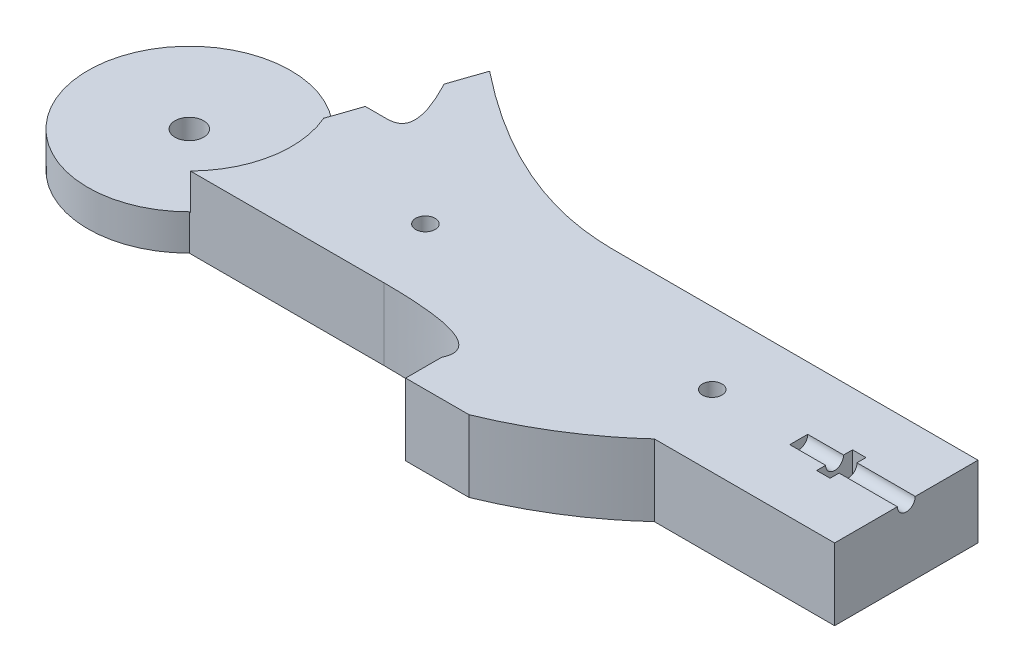
ISO-10303-21;
HEADER;
FILE_DESCRIPTION(('STEP AP214'),'2;1');
FILE_NAME('part.step','',(''),(''),'','','');
FILE_SCHEMA(('AUTOMOTIVE_DESIGN { 1 0 10303 214 1 1 1 1 }'));
ENDSEC;
DATA;
#1=APPLICATION_CONTEXT('core data for automotive mechanical design processes');
#2=APPLICATION_PROTOCOL_DEFINITION('international standard','automotive_design',2000,#1);
#3=PRODUCT_CONTEXT('',#1,'mechanical');
#4=PRODUCT('Part','Part','',(#3));
#5=PRODUCT_RELATED_PRODUCT_CATEGORY('part','',(#4));
#6=PRODUCT_DEFINITION_FORMATION('','',#4);
#7=PRODUCT_DEFINITION_CONTEXT('part definition',#1,'design');
#8=PRODUCT_DEFINITION('design','',#6,#7);
#9=PRODUCT_DEFINITION_SHAPE('','',#8);
#10=(LENGTH_UNIT() NAMED_UNIT(*) SI_UNIT(.MILLI.,.METRE.));
#11=(NAMED_UNIT(*) PLANE_ANGLE_UNIT() SI_UNIT($,.RADIAN.));
#12=(NAMED_UNIT(*) SI_UNIT($,.STERADIAN.) SOLID_ANGLE_UNIT());
#13=UNCERTAINTY_MEASURE_WITH_UNIT(LENGTH_MEASURE(1.E-05),#10,'distance_accuracy_value','');
#14=(GEOMETRIC_REPRESENTATION_CONTEXT(3) GLOBAL_UNCERTAINTY_ASSIGNED_CONTEXT((#13)) GLOBAL_UNIT_ASSIGNED_CONTEXT((#10,
#11,#12)) REPRESENTATION_CONTEXT('',''));
#15=CARTESIAN_POINT('',(0.,0.,0.));
#16=DIRECTION('',(0.,0.,1.));
#17=DIRECTION('',(1.,0.,0.));
#18=AXIS2_PLACEMENT_3D('',#15,#16,#17);
#19=CARTESIAN_POINT('',(-56.5620370370371,12.7,6.10151852993586));
#20=DIRECTION('',(0.,0.,-1.));
#21=DIRECTION('',(1.,0.,0.));
#22=AXIS2_PLACEMENT_3D('',#19,#20,#21);
#23=PLANE('',#22);
#24=DIRECTION('',(0.,1.,0.));
#25=VECTOR('',#24,1.);
#26=CARTESIAN_POINT('',(-22.0521428441884,-49.5130237421217,6.10151852993586));
#27=LINE('',#26,#25);
#28=CARTESIAN_POINT('',(-22.0521428441884,0.,6.10151852993586));
#29=VERTEX_POINT('',#28);
#30=CARTESIAN_POINT('',(-22.0521428441884,12.7,6.10151852993586));
#31=VERTEX_POINT('',#30);
#32=EDGE_CURVE('E221',#29,#31,#27,.T.);
#33=ORIENTED_EDGE('',*,*,#32,.T.);
#34=DIRECTION('',(-1.,0.,0.));
#35=VECTOR('',#34,1.);
#36=CARTESIAN_POINT('',(-56.5620370370371,12.7,6.10151852993586));
#37=LINE('',#36,#35);
#38=CARTESIAN_POINT('',(-56.3690348168402,12.7,6.10151852993586));
#39=VERTEX_POINT('',#38);
#40=EDGE_CURVE('E217',#31,#39,#37,.T.);
#41=ORIENTED_EDGE('',*,*,#40,.T.);
#42=DIRECTION('',(0.,1.,0.));
#43=VECTOR('',#42,1.);
#44=CARTESIAN_POINT('',(-56.3690348168402,6.35,6.10151852993586));
#45=LINE('',#44,#43);
#46=CARTESIAN_POINT('',(-56.3690348168402,6.35,6.10151852993586));
#47=VERTEX_POINT('',#46);
#48=EDGE_CURVE('E399',#47,#39,#45,.T.);
#49=ORIENTED_EDGE('',*,*,#48,.F.);
#50=DIRECTION('',(-1.,0.,0.));
#51=VECTOR('',#50,1.);
#52=CARTESIAN_POINT('',(-56.5620370370371,6.35,6.10151852993586));
#53=LINE('',#52,#51);
#54=CARTESIAN_POINT('',(-56.5620370370371,6.35,6.10151852993585));
#55=VERTEX_POINT('',#54);
#56=EDGE_CURVE('E396',#47,#55,#53,.T.);
#57=ORIENTED_EDGE('',*,*,#56,.T.);
#58=DIRECTION('',(0.,-1.,0.));
#59=VECTOR('',#58,1.);
#60=CARTESIAN_POINT('',(-56.5620370370371,12.7,6.10151852993586));
#61=LINE('',#60,#59);
#62=CARTESIAN_POINT('',(-56.5620370370371,0.,6.10151852993586));
#63=VERTEX_POINT('',#62);
#64=EDGE_CURVE('E435',#55,#63,#61,.T.);
#65=ORIENTED_EDGE('',*,*,#64,.T.);
#66=DIRECTION('',(-1.,0.,0.));
#67=VECTOR('',#66,1.);
#68=CARTESIAN_POINT('',(-56.5620370370371,0.,6.10151852993586));
#69=LINE('',#68,#67);
#70=EDGE_CURVE('E419',#29,#63,#69,.T.);
#71=ORIENTED_EDGE('',*,*,#70,.F.);
#72=EDGE_LOOP('',(#33,#41,#49,#57,#65,#71));
#73=FACE_BOUND('',#72,.T.);
#74=ADVANCED_FACE('F37',(#73),#23,.F.);
#75=DIRECTION('',(0.,1.,0.));
#76=VECTOR('',#75,1.);
#77=CARTESIAN_POINT('',(25.8044086413491,-49.5130237421217,6.10151852993586));
#78=LINE('',#77,#76);
#79=CARTESIAN_POINT('',(25.8044086413491,0.,6.10151852993586));
#80=VERTEX_POINT('',#79);
#81=CARTESIAN_POINT('',(25.8044086413491,12.7,6.10151852993586));
#82=VERTEX_POINT('',#81);
#83=EDGE_CURVE('E256',#80,#82,#78,.T.);
#84=ORIENTED_EDGE('',*,*,#83,.F.);
#85=CARTESIAN_POINT('',(57.7379629629629,0.,6.10151852993586));
#86=VERTEX_POINT('',#85);
#87=EDGE_CURVE('E420',#86,#80,#69,.T.);
#88=ORIENTED_EDGE('',*,*,#87,.F.);
#89=DIRECTION('',(0.,-1.,0.));
#90=VECTOR('',#89,1.);
#91=CARTESIAN_POINT('',(57.7379629629629,12.7,6.10151852993586));
#92=LINE('',#91,#90);
#93=CARTESIAN_POINT('',(57.7379629629629,12.7,6.10151852993586));
#94=VERTEX_POINT('',#93);
#95=EDGE_CURVE('E438',#94,#86,#92,.T.);
#96=ORIENTED_EDGE('',*,*,#95,.F.);
#97=EDGE_CURVE('E410',#94,#82,#37,.T.);
#98=ORIENTED_EDGE('',*,*,#97,.T.);
#99=EDGE_LOOP('',(#84,#88,#96,#98));
#100=FACE_BOUND('',#99,.T.);
#101=ADVANCED_FACE('F575',(#100),#23,.F.);
#102=CARTESIAN_POINT('',(-56.5620370370371,12.7,-19.2984814700641));
#103=DIRECTION('',(0.,0.,1.));
#104=DIRECTION('',(-1.,0.,0.));
#105=AXIS2_PLACEMENT_3D('',#102,#103,#104);
#106=PLANE('',#105);
#107=DIRECTION('',(0.,1.,0.));
#108=VECTOR('',#107,1.);
#109=CARTESIAN_POINT('',(-5.57588640904783,-44.9106074814327,-19.2984814700641));
#110=LINE('',#109,#108);
#111=CARTESIAN_POINT('',(-5.57588640904783,0.,-19.2984814700641));
#112=VERTEX_POINT('',#111);
#113=CARTESIAN_POINT('',(-5.57588640904783,12.7,-19.2984814700641));
#114=VERTEX_POINT('',#113);
#115=EDGE_CURVE('E488',#112,#114,#110,.T.);
#116=ORIENTED_EDGE('',*,*,#115,.T.);
#117=DIRECTION('',(1.,0.,0.));
#118=VECTOR('',#117,1.);
#119=CARTESIAN_POINT('',(-56.5620370370371,12.7,-19.2984814700641));
#120=LINE('',#119,#118);
#121=CARTESIAN_POINT('',(57.7379629629629,12.7,-19.2984814700641));
#122=VERTEX_POINT('',#121);
#123=EDGE_CURVE('E413',#114,#122,#120,.T.);
#124=ORIENTED_EDGE('',*,*,#123,.T.);
#125=DIRECTION('',(0.,-1.,0.));
#126=VECTOR('',#125,1.);
#127=CARTESIAN_POINT('',(57.7379629629629,12.7,-19.2984814700641));
#128=LINE('',#127,#126);
#129=CARTESIAN_POINT('',(57.7379629629629,0.,-19.2984814700641));
#130=VERTEX_POINT('',#129);
#131=EDGE_CURVE('E417',#122,#130,#128,.T.);
#132=ORIENTED_EDGE('',*,*,#131,.T.);
#133=DIRECTION('',(1.,0.,0.));
#134=VECTOR('',#133,1.);
#135=CARTESIAN_POINT('',(-56.5620370370371,0.,-19.2984814700641));
#136=LINE('',#135,#134);
#137=EDGE_CURVE('E426',#112,#130,#136,.T.);
#138=ORIENTED_EDGE('',*,*,#137,.F.);
#139=EDGE_LOOP('',(#116,#124,#132,#138));
#140=FACE_BOUND('',#139,.T.);
#141=ADVANCED_FACE('F489',(#140),#106,.F.);
#142=CARTESIAN_POINT('',(38.6879629629629,12.7,-6.59848147006414));
#143=DIRECTION('',(1.,0.,0.));
#144=DIRECTION('',(0.,0.,1.));
#145=AXIS2_PLACEMENT_3D('',#142,#143,#144);
#146=CYLINDRICAL_SURFACE('',#145,1.5875);
#147=DIRECTION('',(1.,0.,0.));
#148=VECTOR('',#147,1.);
#149=CARTESIAN_POINT('',(38.6879629629629,12.7,-8.18598147006414));
#150=LINE('',#149,#148);
#151=CARTESIAN_POINT('',(45.0379629629629,12.7,-8.18598147006414));
#152=VERTEX_POINT('',#151);
#153=CARTESIAN_POINT('',(38.6879629629629,12.7,-8.18598147006414));
#154=VERTEX_POINT('',#153);
#155=EDGE_CURVE('E353',#152,#154,#150,.F.);
#156=ORIENTED_EDGE('',*,*,#155,.T.);
#157=CARTESIAN_POINT('',(38.6879629629629,12.7,-6.59848147006414));
#158=DIRECTION('',(-1.,0.,0.));
#159=DIRECTION('',(0.,0.,1.));
#160=AXIS2_PLACEMENT_3D('',#157,#158,#159);
#161=CIRCLE('',#160,1.5875);
#162=CARTESIAN_POINT('',(38.6879629629629,12.7,-5.01098147006414));
#163=VERTEX_POINT('',#162);
#164=EDGE_CURVE('E350',#154,#163,#161,.T.);
#165=ORIENTED_EDGE('',*,*,#164,.T.);
#166=DIRECTION('',(1.,0.,0.));
#167=VECTOR('',#166,1.);
#168=CARTESIAN_POINT('',(38.6879629629629,12.7,-5.01098147006414));
#169=LINE('',#168,#167);
#170=CARTESIAN_POINT('',(45.0379629629629,12.7,-5.01098147006415));
#171=VERTEX_POINT('',#170);
#172=EDGE_CURVE('E358',#163,#171,#169,.T.);
#173=ORIENTED_EDGE('',*,*,#172,.T.);
#174=CARTESIAN_POINT('',(45.0379629629629,12.7,-6.59848147006414));
#175=DIRECTION('',(1.,0.,0.));
#176=DIRECTION('',(0.,0.,-1.));
#177=AXIS2_PLACEMENT_3D('',#174,#175,#176);
#178=CIRCLE('',#177,1.5875);
#179=EDGE_CURVE('E11',#152,#171,#178,.F.);
#180=ORIENTED_EDGE('',*,*,#179,.F.);
#181=EDGE_LOOP('',(#156,#165,#173,#180));
#182=FACE_BOUND('',#181,.T.);
#183=ADVANCED_FACE('F571',(#182),#146,.F.);
#184=CARTESIAN_POINT('',(-69.262037037037,12.7,-6.59848147006414));
#185=DIRECTION('',(0.,-1.,0.));
#186=DIRECTION('',(0.,0.,1.));
#187=AXIS2_PLACEMENT_3D('',#184,#185,#186);
#188=CYLINDRICAL_SURFACE('',#187,17.9605122421383);
#189=CARTESIAN_POINT('',(-69.262037037037,6.35,-6.59848147006414));
#190=DIRECTION('',(0.,-1.,0.));
#191=DIRECTION('',(0.,0.,-1.));
#192=AXIS2_PLACEMENT_3D('',#189,#190,#191);
#193=CIRCLE('',#192,17.9605122421383);
#194=CARTESIAN_POINT('',(-56.5620370370371,6.35,-19.2984814700641));
#195=VERTEX_POINT('',#194);
#196=EDGE_CURVE('E393',#55,#195,#193,.T.);
#197=ORIENTED_EDGE('',*,*,#196,.T.);
#198=DIRECTION('',(0.,-1.,0.));
#199=VECTOR('',#198,1.);
#200=CARTESIAN_POINT('',(-56.5620370370371,12.7,-19.2984814700641));
#201=LINE('',#200,#199);
#202=CARTESIAN_POINT('',(-56.5620370370371,0.,-19.2984814700641));
#203=VERTEX_POINT('',#202);
#204=EDGE_CURVE('E432',#195,#203,#201,.T.);
#205=ORIENTED_EDGE('',*,*,#204,.T.);
#206=CARTESIAN_POINT('',(-69.262037037037,0.,-6.59848147006414));
#207=DIRECTION('',(0.,-1.,0.));
#208=DIRECTION('',(0.,0.,1.));
#209=AXIS2_PLACEMENT_3D('',#206,#207,#208);
#210=CIRCLE('',#209,17.9605122421383);
#211=EDGE_CURVE('E423',#63,#203,#210,.T.);
#212=ORIENTED_EDGE('',*,*,#211,.F.);
#213=ORIENTED_EDGE('',*,*,#64,.F.);
#214=EDGE_LOOP('',(#197,#205,#212,#213));
#215=FACE_BOUND('',#214,.T.);
#216=ADVANCED_FACE('F552',(#215),#188,.T.);
#217=CARTESIAN_POINT('',(-69.262037037037,12.7,-6.59848147006414));
#218=DIRECTION('',(0.,-1.,0.));
#219=DIRECTION('',(0.,0.,1.));
#220=AXIS2_PLACEMENT_3D('',#217,#218,#219);
#221=CYLINDRICAL_SURFACE('',#220,2.54);
#222=CARTESIAN_POINT('',(-69.262037037037,0.,-6.59848147006414));
#223=DIRECTION('',(0.,-1.,0.));
#224=DIRECTION('',(0.,0.,-1.));
#225=AXIS2_PLACEMENT_3D('',#222,#223,#224);
#226=CIRCLE('',#225,2.54);
#227=CARTESIAN_POINT('',(-69.262037037037,0.,-9.13848147006414));
#228=VERTEX_POINT('',#227);
#229=EDGE_CURVE('E402',#228,#228,#226,.T.);
#230=ORIENTED_EDGE('',*,*,#229,.T.);
#231=EDGE_LOOP('',(#230));
#232=FACE_BOUND('',#231,.T.);
#233=CARTESIAN_POINT('',(-69.262037037037,6.35,-6.59848147006414));
#234=DIRECTION('',(0.,-1.,0.));
#235=DIRECTION('',(0.,0.,-1.));
#236=AXIS2_PLACEMENT_3D('',#233,#234,#235);
#237=CIRCLE('',#236,2.54);
#238=CARTESIAN_POINT('',(-69.262037037037,6.35,-9.13848147006414));
#239=VERTEX_POINT('',#238);
#240=EDGE_CURVE('E388',#239,#239,#237,.T.);
#241=ORIENTED_EDGE('',*,*,#240,.F.);
#242=EDGE_LOOP('',(#241));
#243=FACE_BOUND('',#242,.T.);
#244=ADVANCED_FACE('F561',(#232,#243),#221,.F.);
#245=CARTESIAN_POINT('',(-69.262037037037,12.7,-6.59848147006414));
#246=DIRECTION('',(0.,-1.,0.));
#247=DIRECTION('',(0.,0.,1.));
#248=AXIS2_PLACEMENT_3D('',#245,#246,#247);
#249=PLANE('',#248);
#250=CARTESIAN_POINT('',(-27.4422931581062,12.7,-6.59848147006414));
#251=DIRECTION('',(0.,1.,0.));
#252=DIRECTION('',(0.,0.,1.));
#253=AXIS2_PLACEMENT_3D('',#250,#251,#252);
#254=CIRCLE('',#253,1.72720000000001);
#255=CARTESIAN_POINT('',(-27.4422931581062,12.7,-4.87128147006413));
#256=VERTEX_POINT('',#255);
#257=EDGE_CURVE('E370',#256,#256,#254,.T.);
#258=ORIENTED_EDGE('',*,*,#257,.F.);
#259=EDGE_LOOP('',(#258));
#260=FACE_BOUND('',#259,.T.);
#261=CARTESIAN_POINT('',(23.3577068418938,12.7,-6.59848147006414));
#262=DIRECTION('',(0.,1.,0.));
#263=DIRECTION('',(0.,0.,1.));
#264=AXIS2_PLACEMENT_3D('',#261,#262,#263);
#265=CIRCLE('',#264,1.72720000000001);
#266=CARTESIAN_POINT('',(23.3577068418938,12.7,-4.87128147006413));
#267=VERTEX_POINT('',#266);
#268=EDGE_CURVE('E382',#267,#267,#265,.T.);
#269=ORIENTED_EDGE('',*,*,#268,.F.);
#270=EDGE_LOOP('',(#269));
#271=FACE_BOUND('',#270,.T.);
#272=ORIENTED_EDGE('',*,*,#172,.F.);
#273=DIRECTION('',(0.,0.,-1.));
#274=VECTOR('',#273,1.);
#275=CARTESIAN_POINT('',(38.6879629629629,12.7,-6.59848147006414));
#276=LINE('',#275,#274);
#277=EDGE_CURVE('E445',#163,#154,#276,.T.);
#278=ORIENTED_EDGE('',*,*,#277,.T.);
#279=ORIENTED_EDGE('',*,*,#155,.F.);
#280=DIRECTION('',(0.,0.,-1.));
#281=VECTOR('',#280,1.);
#282=CARTESIAN_POINT('',(45.0379629629629,12.7,-9.77348147006416));
#283=LINE('',#282,#281);
#284=CARTESIAN_POINT('',(45.0379629629629,12.7,-9.77348147006416));
#285=VERTEX_POINT('',#284);
#286=EDGE_CURVE('E329',#152,#285,#283,.T.);
#287=ORIENTED_EDGE('',*,*,#286,.T.);
#288=DIRECTION('',(1.,0.,0.));
#289=VECTOR('',#288,1.);
#290=CARTESIAN_POINT('',(45.0379629629629,12.7,-9.77348147006416));
#291=LINE('',#290,#289);
#292=CARTESIAN_POINT('',(47.4192129629629,12.7,-9.77348147006416));
#293=VERTEX_POINT('',#292);
#294=EDGE_CURVE('E318',#285,#293,#291,.T.);
#295=ORIENTED_EDGE('',*,*,#294,.T.);
#296=DIRECTION('',(0.,0.,1.));
#297=VECTOR('',#296,1.);
#298=CARTESIAN_POINT('',(47.4192129629629,12.7,-3.42348147006413));
#299=LINE('',#298,#297);
#300=CARTESIAN_POINT('',(47.4192129629629,12.7,-8.18598147006414));
#301=VERTEX_POINT('',#300);
#302=EDGE_CURVE('E323',#293,#301,#299,.T.);
#303=ORIENTED_EDGE('',*,*,#302,.T.);
#304=CARTESIAN_POINT('',(57.7379629629629,12.7,-8.18598147006414));
#305=VERTEX_POINT('',#304);
#306=EDGE_CURVE('E354',#305,#301,#150,.F.);
#307=ORIENTED_EDGE('',*,*,#306,.F.);
#308=DIRECTION('',(0.,0.,1.));
#309=VECTOR('',#308,1.);
#310=CARTESIAN_POINT('',(57.7379629629629,12.7,6.10151852993586));
#311=LINE('',#310,#309);
#312=EDGE_CURVE('E406',#122,#305,#311,.T.);
#313=ORIENTED_EDGE('',*,*,#312,.F.);
#314=ORIENTED_EDGE('',*,*,#123,.F.);
#315=CARTESIAN_POINT('',(-45.1817352564269,12.7,-35.7159023104307));
#316=CARTESIAN_POINT('',(-24.6245664486509,12.7,-19.2984814700641));
#317=CARTESIAN_POINT('',(-11.56568916727,12.7,-19.2984814700641));
#318=CARTESIAN_POINT('',(-5.57588640904783,12.7,-19.2984814700641));
#319=B_SPLINE_CURVE_WITH_KNOTS('',3,(#315,#316,#317,#318),.UNSPECIFIED.,.F.,.F.,(4,4),(0.,1.),.UNSPECIFIED.);
#320=CARTESIAN_POINT('',(-45.1817352564269,12.7,-35.7159023104307));
#321=VERTEX_POINT('',#320);
#322=EDGE_CURVE('E484',#321,#114,#319,.T.);
#323=ORIENTED_EDGE('',*,*,#322,.F.);
#324=DIRECTION('',(-0.322805874294675,0.,0.946465196148728));
#325=VECTOR('',#324,1.);
#326=CARTESIAN_POINT('',(-45.1817352564269,12.7,-35.7159023104307));
#327=LINE('',#326,#325);
#328=CARTESIAN_POINT('',(-47.2315525581981,12.7,-29.7058483148863));
#329=VERTEX_POINT('',#328);
#330=EDGE_CURVE('E322',#321,#329,#327,.T.);
#331=ORIENTED_EDGE('',*,*,#330,.T.);
#332=CARTESIAN_POINT('',(-47.2315525581981,12.7,-29.7058483148863));
#333=CARTESIAN_POINT('',(-41.7251153372007,12.7,-19.2984814700641));
#334=CARTESIAN_POINT('',(-45.408751787825,12.7,-19.2984814700641));
#335=CARTESIAN_POINT('',(-47.3781705248904,12.7,-19.2984814700641));
#336=B_SPLINE_CURVE_WITH_KNOTS('',3,(#332,#333,#334,#335),.UNSPECIFIED.,.F.,.F.,(4,4),(0.,1.),.UNSPECIFIED.);
#337=CARTESIAN_POINT('',(-47.3781705248904,12.7,-19.2984814700641));
#338=VERTEX_POINT('',#337);
#339=EDGE_CURVE('E500',#329,#338,#336,.T.);
#340=ORIENTED_EDGE('',*,*,#339,.T.);
#341=CARTESIAN_POINT('',(-50.7811380761005,12.7,-19.2984814700641));
#342=VERTEX_POINT('',#341);
#343=EDGE_CURVE('E414',#342,#338,#120,.T.);
#344=ORIENTED_EDGE('',*,*,#343,.F.);
#345=DIRECTION('',(-0.322805874294675,0.,0.946465196148728));
#346=VECTOR('',#345,1.);
#347=CARTESIAN_POINT('',(-50.7811380761005,12.7,-19.2984814700641));
#348=LINE('',#347,#346);
#349=CARTESIAN_POINT('',(-52.6576296854306,12.7,-13.796617531012));
#350=VERTEX_POINT('',#349);
#351=EDGE_CURVE('E341',#342,#350,#348,.T.);
#352=ORIENTED_EDGE('',*,*,#351,.T.);
#353=CARTESIAN_POINT('',(-69.262037037037,12.7,-6.59848147006414));
#354=DIRECTION('',(0.,-1.,0.));
#355=DIRECTION('',(0.,0.,-1.));
#356=AXIS2_PLACEMENT_3D('',#353,#354,#355);
#357=CIRCLE('',#356,18.0975);
#358=EDGE_CURVE('E385',#350,#39,#357,.T.);
#359=ORIENTED_EDGE('',*,*,#358,.T.);
#360=ORIENTED_EDGE('',*,*,#40,.F.);
#361=CARTESIAN_POINT('',(-5.54086763995443,12.7,12.4515185299359));
#362=CARTESIAN_POINT('',(-2.45676013605589,12.7,6.10151852993586));
#363=CARTESIAN_POINT('',(-22.0521428441884,12.7,6.10151852993586));
#364=B_SPLINE_CURVE_WITH_KNOTS('',2,(#361,#362,#363),.UNSPECIFIED.,.F.,.F.,(3,3),(0.,1.),.UNSPECIFIED.);
#365=CARTESIAN_POINT('',(-5.54086763995443,12.7,12.4515185299359));
#366=VERTEX_POINT('',#365);
#367=EDGE_CURVE('E60',#366,#31,#364,.T.);
#368=ORIENTED_EDGE('',*,*,#367,.F.);
#369=DIRECTION('',(0.,0.,1.));
#370=VECTOR('',#369,1.);
#371=CARTESIAN_POINT('',(-5.54086763995443,12.7,12.4515185299359));
#372=LINE('',#371,#370);
#373=CARTESIAN_POINT('',(-5.54086763995443,12.7,18.8015185299359));
#374=VERTEX_POINT('',#373);
#375=EDGE_CURVE('E203',#366,#374,#372,.T.);
#376=ORIENTED_EDGE('',*,*,#375,.T.);
#377=DIRECTION('',(1.,0.,0.));
#378=VECTOR('',#377,1.);
#379=CARTESIAN_POINT('',(-5.54086763995443,12.7,18.8015185299359));
#380=LINE('',#379,#378);
#381=CARTESIAN_POINT('',(5.68711721311388,12.7,18.8015185299359));
#382=VERTEX_POINT('',#381);
#383=EDGE_CURVE('E204',#374,#382,#380,.T.);
#384=ORIENTED_EDGE('',*,*,#383,.T.);
#385=CARTESIAN_POINT('',(5.68711721311388,12.7,18.8015185299359));
#386=CARTESIAN_POINT('',(17.0941996057411,12.7,14.1176448631186));
#387=CARTESIAN_POINT('',(25.8044086413491,12.7,6.10151852993586));
#388=B_SPLINE_CURVE_WITH_KNOTS('',2,(#385,#386,#387),.UNSPECIFIED.,.F.,.F.,(3,3),(0.,
0.7699329234087),.UNSPECIFIED.);
#389=EDGE_CURVE('E228',#382,#82,#388,.T.);
#390=ORIENTED_EDGE('',*,*,#389,.T.);
#391=ORIENTED_EDGE('',*,*,#97,.F.);
#392=CARTESIAN_POINT('',(57.7379629629629,12.7,-5.01098147006414));
#393=VERTEX_POINT('',#392);
#394=EDGE_CURVE('E409',#393,#94,#311,.T.);
#395=ORIENTED_EDGE('',*,*,#394,.F.);
#396=CARTESIAN_POINT('',(47.4192129629629,12.7,-5.01098147006414));
#397=VERTEX_POINT('',#396);
#398=EDGE_CURVE('E357',#397,#393,#169,.T.);
#399=ORIENTED_EDGE('',*,*,#398,.F.);
#400=CARTESIAN_POINT('',(47.4192129629629,12.7,-3.42348147006413));
#401=VERTEX_POINT('',#400);
#402=EDGE_CURVE('E321',#397,#401,#299,.T.);
#403=ORIENTED_EDGE('',*,*,#402,.T.);
#404=DIRECTION('',(-1.,0.,0.));
#405=VECTOR('',#404,1.);
#406=CARTESIAN_POINT('',(45.0379629629629,12.7,-3.42348147006413));
#407=LINE('',#406,#405);
#408=CARTESIAN_POINT('',(45.0379629629629,12.7,-3.42348147006413));
#409=VERTEX_POINT('',#408);
#410=EDGE_CURVE('E326',#401,#409,#407,.T.);
#411=ORIENTED_EDGE('',*,*,#410,.T.);
#412=EDGE_CURVE('E330',#409,#171,#283,.T.);
#413=ORIENTED_EDGE('',*,*,#412,.T.);
#414=EDGE_LOOP('',(#272,#278,#279,#287,#295,#303,#307,#313,#314,#323,#331,#340,#344,#352,#359,
#360,#368,#376,#384,#390,#391,#395,#399,#403,#411,#413));
#415=FACE_BOUND('',#414,.T.);
#416=ADVANCED_FACE('F215',(#260,#271,#415),#249,.F.);
#417=CARTESIAN_POINT('',(-69.262037037037,0.,-6.59848147006414));
#418=DIRECTION('',(0.,-1.,0.));
#419=DIRECTION('',(0.,0.,1.));
#420=AXIS2_PLACEMENT_3D('',#417,#418,#419);
#421=PLANE('',#420);
#422=CARTESIAN_POINT('',(-27.4422931581062,0.,-6.59848147006414));
#423=DIRECTION('',(0.,1.,0.));
#424=DIRECTION('',(0.,0.,1.));
#425=AXIS2_PLACEMENT_3D('',#422,#423,#424);
#426=CIRCLE('',#425,3.77062999999999);
#427=CARTESIAN_POINT('',(-27.4422931581062,0.,-2.82785147006415));
#428=VERTEX_POINT('',#427);
#429=EDGE_CURVE('E361',#428,#428,#426,.T.);
#430=ORIENTED_EDGE('',*,*,#429,.T.);
#431=EDGE_LOOP('',(#430));
#432=FACE_BOUND('',#431,.T.);
#433=CARTESIAN_POINT('',(23.3577068418938,0.,-6.59848147006414));
#434=DIRECTION('',(0.,1.,0.));
#435=DIRECTION('',(0.,0.,1.));
#436=AXIS2_PLACEMENT_3D('',#433,#434,#435);
#437=CIRCLE('',#436,3.77062999999999);
#438=CARTESIAN_POINT('',(23.3577068418938,0.,-2.82785147006415));
#439=VERTEX_POINT('',#438);
#440=EDGE_CURVE('E373',#439,#439,#437,.T.);
#441=ORIENTED_EDGE('',*,*,#440,.T.);
#442=EDGE_LOOP('',(#441));
#443=FACE_BOUND('',#442,.T.);
#444=DIRECTION('',(0.,0.,1.));
#445=VECTOR('',#444,1.);
#446=CARTESIAN_POINT('',(57.7379629629629,0.,6.10151852993586));
#447=LINE('',#446,#445);
#448=EDGE_CURVE('E405',#130,#86,#447,.T.);
#449=ORIENTED_EDGE('',*,*,#448,.T.);
#450=ORIENTED_EDGE('',*,*,#87,.T.);
#451=CARTESIAN_POINT('',(5.68711721311388,0.,18.8015185299359));
#452=CARTESIAN_POINT('',(17.0941996057411,0.,14.1176448631186));
#453=CARTESIAN_POINT('',(25.8044086413491,0.,6.10151852993586));
#454=B_SPLINE_CURVE_WITH_KNOTS('',2,(#451,#452,#453),.UNSPECIFIED.,.F.,.F.,(3,3),(0.,
0.7699329234087),.UNSPECIFIED.);
#455=CARTESIAN_POINT('',(5.68711721311388,0.,18.8015185299359));
#456=VERTEX_POINT('',#455);
#457=EDGE_CURVE('E219',#456,#80,#454,.T.);
#458=ORIENTED_EDGE('',*,*,#457,.F.);
#459=DIRECTION('',(1.,0.,0.));
#460=VECTOR('',#459,1.);
#461=CARTESIAN_POINT('',(-5.54086763995443,0.,18.8015185299359));
#462=LINE('',#461,#460);
#463=CARTESIAN_POINT('',(-5.54086763995443,0.,18.8015185299359));
#464=VERTEX_POINT('',#463);
#465=EDGE_CURVE('E223',#464,#456,#462,.T.);
#466=ORIENTED_EDGE('',*,*,#465,.F.);
#467=DIRECTION('',(0.,0.,1.));
#468=VECTOR('',#467,1.);
#469=CARTESIAN_POINT('',(-5.54086763995443,0.,12.4515185299359));
#470=LINE('',#469,#468);
#471=CARTESIAN_POINT('',(-5.54086763995443,0.,12.4515185299359));
#472=VERTEX_POINT('',#471);
#473=EDGE_CURVE('E242',#472,#464,#470,.T.);
#474=ORIENTED_EDGE('',*,*,#473,.F.);
#475=CARTESIAN_POINT('',(-5.54086763995443,0.,12.4515185299359));
#476=CARTESIAN_POINT('',(-2.45676013605589,0.,6.10151852993586));
#477=CARTESIAN_POINT('',(-22.0521428441884,0.,6.10151852993586));
#478=B_SPLINE_CURVE_WITH_KNOTS('',2,(#475,#476,#477),.UNSPECIFIED.,.F.,.F.,(3,3),(0.,1.),.UNSPECIFIED.);
#479=EDGE_CURVE('E52',#472,#29,#478,.T.);
#480=ORIENTED_EDGE('',*,*,#479,.T.);
#481=ORIENTED_EDGE('',*,*,#70,.T.);
#482=ORIENTED_EDGE('',*,*,#211,.T.);
#483=CARTESIAN_POINT('',(-47.3781705248904,0.,-19.2984814700641));
#484=VERTEX_POINT('',#483);
#485=EDGE_CURVE('E427',#203,#484,#136,.T.);
#486=ORIENTED_EDGE('',*,*,#485,.T.);
#487=CARTESIAN_POINT('',(-47.2315525581981,0.,-29.7058483148863));
#488=CARTESIAN_POINT('',(-41.7251153372007,0.,-19.2984814700641));
#489=CARTESIAN_POINT('',(-45.408751787825,0.,-19.2984814700641));
#490=CARTESIAN_POINT('',(-47.3781705248904,0.,-19.2984814700641));
#491=B_SPLINE_CURVE_WITH_KNOTS('',3,(#487,#488,#489,#490),.UNSPECIFIED.,.F.,.F.,(4,4),(0.,1.),.UNSPECIFIED.);
#492=CARTESIAN_POINT('',(-47.2315525581981,0.,-29.7058483148863));
#493=VERTEX_POINT('',#492);
#494=EDGE_CURVE('E501',#493,#484,#491,.T.);
#495=ORIENTED_EDGE('',*,*,#494,.F.);
#496=DIRECTION('',(-0.322805874294675,0.,0.946465196148728));
#497=VECTOR('',#496,1.);
#498=CARTESIAN_POINT('',(-45.1817352564269,0.,-35.7159023104307));
#499=LINE('',#498,#497);
#500=CARTESIAN_POINT('',(-45.1817352564269,0.,-35.7159023104307));
#501=VERTEX_POINT('',#500);
#502=EDGE_CURVE('E212',#501,#493,#499,.T.);
#503=ORIENTED_EDGE('',*,*,#502,.F.);
#504=CARTESIAN_POINT('',(-45.1817352564269,0.,-35.7159023104307));
#505=CARTESIAN_POINT('',(-24.6245664486509,0.,-19.2984814700641));
#506=CARTESIAN_POINT('',(-11.56568916727,0.,-19.2984814700641));
#507=CARTESIAN_POINT('',(-5.57588640904783,0.,-19.2984814700641));
#508=B_SPLINE_CURVE_WITH_KNOTS('',3,(#504,#505,#506,#507),.UNSPECIFIED.,.F.,.F.,(4,4),(0.,1.),.UNSPECIFIED.);
#509=EDGE_CURVE('E494',#501,#112,#508,.T.);
#510=ORIENTED_EDGE('',*,*,#509,.T.);
#511=ORIENTED_EDGE('',*,*,#137,.T.);
#512=EDGE_LOOP('',(#449,#450,#458,#466,#474,#480,#481,#482,#486,#495,#503,#510,#511));
#513=FACE_BOUND('',#512,.T.);
#514=ORIENTED_EDGE('',*,*,#229,.F.);
#515=EDGE_LOOP('',(#514));
#516=FACE_BOUND('',#515,.T.);
#517=ADVANCED_FACE('F549',(#432,#443,#513,#516),#421,.T.);
#518=CARTESIAN_POINT('',(57.7379629629629,12.7,6.10151852993586));
#519=DIRECTION('',(-1.,0.,0.));
#520=DIRECTION('',(0.,0.,-1.));
#521=AXIS2_PLACEMENT_3D('',#518,#519,#520);
#522=PLANE('',#521);
#523=ORIENTED_EDGE('',*,*,#394,.T.);
#524=ORIENTED_EDGE('',*,*,#95,.T.);
#525=ORIENTED_EDGE('',*,*,#448,.F.);
#526=ORIENTED_EDGE('',*,*,#131,.F.);
#527=ORIENTED_EDGE('',*,*,#312,.T.);
#528=CARTESIAN_POINT('',(57.7379629629629,12.7,-6.59848147006414));
#529=DIRECTION('',(1.,0.,0.));
#530=DIRECTION('',(0.,0.,-1.));
#531=AXIS2_PLACEMENT_3D('',#528,#529,#530);
#532=CIRCLE('',#531,1.5875);
#533=EDGE_CURVE('E441',#393,#305,#532,.T.);
#534=ORIENTED_EDGE('',*,*,#533,.F.);
#535=EDGE_LOOP('',(#523,#524,#525,#526,#527,#534));
#536=FACE_BOUND('',#535,.T.);
#537=ADVANCED_FACE('F39',(#536),#522,.F.);
#538=ORIENTED_EDGE('',*,*,#485,.F.);
#539=ORIENTED_EDGE('',*,*,#204,.F.);
#540=DIRECTION('',(1.,0.,0.));
#541=VECTOR('',#540,1.);
#542=CARTESIAN_POINT('',(-56.5620370370371,6.35,-19.2984814700641));
#543=LINE('',#542,#541);
#544=CARTESIAN_POINT('',(-50.7811380761005,6.35,-19.2984814700641));
#545=VERTEX_POINT('',#544);
#546=EDGE_CURVE('E390',#195,#545,#543,.T.);
#547=ORIENTED_EDGE('',*,*,#546,.T.);
#548=DIRECTION('',(0.,1.,0.));
#549=VECTOR('',#548,1.);
#550=CARTESIAN_POINT('',(-50.7811380761005,-2.73699166155966,-19.2984814700641));
#551=LINE('',#550,#549);
#552=EDGE_CURVE('E344',#545,#342,#551,.T.);
#553=ORIENTED_EDGE('',*,*,#552,.T.);
#554=ORIENTED_EDGE('',*,*,#343,.T.);
#555=DIRECTION('',(0.,1.,0.));
#556=VECTOR('',#555,1.);
#557=CARTESIAN_POINT('',(-47.3781705248904,-44.9106074814327,-19.2984814700641));
#558=LINE('',#557,#556);
#559=EDGE_CURVE('E493',#484,#338,#558,.T.);
#560=ORIENTED_EDGE('',*,*,#559,.F.);
#561=EDGE_LOOP('',(#538,#539,#547,#553,#554,#560));
#562=FACE_BOUND('',#561,.T.);
#563=ADVANCED_FACE('F534',(#562),#106,.F.);
#564=CARTESIAN_POINT('',(-69.262037037037,6.35,-6.59848147006414));
#565=DIRECTION('',(0.,1.,0.));
#566=DIRECTION('',(0.,0.,-1.));
#567=AXIS2_PLACEMENT_3D('',#564,#565,#566);
#568=CYLINDRICAL_SURFACE('',#567,18.0975);
#569=CARTESIAN_POINT('',(-69.262037037037,6.35,-6.59848147006414));
#570=DIRECTION('',(0.,-1.,0.));
#571=DIRECTION('',(0.,0.,-1.));
#572=AXIS2_PLACEMENT_3D('',#569,#570,#571);
#573=CIRCLE('',#572,18.0975);
#574=CARTESIAN_POINT('',(-52.6576296854306,6.35,-13.796617531012));
#575=VERTEX_POINT('',#574);
#576=EDGE_CURVE('E386',#575,#47,#573,.T.);
#577=ORIENTED_EDGE('',*,*,#576,.T.);
#578=ORIENTED_EDGE('',*,*,#48,.T.);
#579=ORIENTED_EDGE('',*,*,#358,.F.);
#580=DIRECTION('',(0.,1.,0.));
#581=VECTOR('',#580,1.);
#582=CARTESIAN_POINT('',(-52.6576296854306,-2.73699166155966,-13.796617531012));
#583=LINE('',#582,#581);
#584=EDGE_CURVE('E345',#575,#350,#583,.T.);
#585=ORIENTED_EDGE('',*,*,#584,.F.);
#586=EDGE_LOOP('',(#577,#578,#579,#585));
#587=FACE_BOUND('',#586,.T.);
#588=ADVANCED_FACE('F544',(#587),#568,.F.);
#589=CARTESIAN_POINT('',(-69.262037037037,6.35,-6.59848147006414));
#590=DIRECTION('',(0.,1.,0.));
#591=DIRECTION('',(0.,0.,-1.));
#592=AXIS2_PLACEMENT_3D('',#589,#590,#591);
#593=PLANE('',#592);
#594=ORIENTED_EDGE('',*,*,#196,.F.);
#595=ORIENTED_EDGE('',*,*,#56,.F.);
#596=ORIENTED_EDGE('',*,*,#576,.F.);
#597=DIRECTION('',(0.322805874294675,0.,-0.946465196148728));
#598=VECTOR('',#597,1.);
#599=CARTESIAN_POINT('',(-50.7811380761005,6.35,-19.2984814700641));
#600=LINE('',#599,#598);
#601=EDGE_CURVE('E347',#575,#545,#600,.T.);
#602=ORIENTED_EDGE('',*,*,#601,.T.);
#603=ORIENTED_EDGE('',*,*,#546,.F.);
#604=EDGE_LOOP('',(#594,#595,#596,#602,#603));
#605=FACE_BOUND('',#604,.T.);
#606=ORIENTED_EDGE('',*,*,#240,.T.);
#607=EDGE_LOOP('',(#606));
#608=FACE_BOUND('',#607,.T.);
#609=ADVANCED_FACE('F554',(#605,#608),#593,.T.);
#610=CARTESIAN_POINT('',(23.3577068418938,0.,-6.59848147006414));
#611=DIRECTION('',(0.,-1.,0.));
#612=DIRECTION('',(0.,0.,1.));
#613=AXIS2_PLACEMENT_3D('',#610,#611,#612);
#614=CYLINDRICAL_SURFACE('',#613,1.7272);
#615=ORIENTED_EDGE('',*,*,#268,.T.);
#616=EDGE_LOOP('',(#615));
#617=FACE_BOUND('',#616,.T.);
#618=CARTESIAN_POINT('',(23.3577068418938,1.9812,-6.59848147006414));
#619=DIRECTION('',(0.,1.,0.));
#620=DIRECTION('',(0.,0.,1.));
#621=AXIS2_PLACEMENT_3D('',#618,#619,#620);
#622=CIRCLE('',#621,1.7272);
#623=CARTESIAN_POINT('',(23.3577068418938,1.9812,-4.87128147006415));
#624=VERTEX_POINT('',#623);
#625=EDGE_CURVE('E379',#624,#624,#622,.T.);
#626=ORIENTED_EDGE('',*,*,#625,.F.);
#627=EDGE_LOOP('',(#626));
#628=FACE_BOUND('',#627,.T.);
#629=ADVANCED_FACE('F557',(#617,#628),#614,.F.);
#630=CARTESIAN_POINT('',(25.0849068418938,1.9812,-6.59848147006414));
#631=DIRECTION('',(0.,1.,0.));
#632=DIRECTION('',(0.,0.,-1.));
#633=AXIS2_PLACEMENT_3D('',#630,#631,#632);
#634=PLANE('',#633);
#635=ORIENTED_EDGE('',*,*,#625,.T.);
#636=EDGE_LOOP('',(#635));
#637=FACE_BOUND('',#636,.T.);
#638=CARTESIAN_POINT('',(23.3577068418938,1.9812,-6.59848147006414));
#639=DIRECTION('',(0.,1.,0.));
#640=DIRECTION('',(0.,0.,1.));
#641=AXIS2_PLACEMENT_3D('',#638,#639,#640);
#642=CIRCLE('',#641,3.77063);
#643=CARTESIAN_POINT('',(23.3577068418938,1.9812,-2.82785147006415));
#644=VERTEX_POINT('',#643);
#645=EDGE_CURVE('E376',#644,#644,#642,.T.);
#646=ORIENTED_EDGE('',*,*,#645,.F.);
#647=EDGE_LOOP('',(#646));
#648=FACE_BOUND('',#647,.T.);
#649=ADVANCED_FACE('F595',(#637,#648),#634,.F.);
#650=CARTESIAN_POINT('',(23.3577068418938,0.,-6.59848147006414));
#651=DIRECTION('',(0.,-1.,0.));
#652=DIRECTION('',(0.,0.,1.));
#653=AXIS2_PLACEMENT_3D('',#650,#651,#652);
#654=CYLINDRICAL_SURFACE('',#653,3.77063);
#655=ORIENTED_EDGE('',*,*,#645,.T.);
#656=EDGE_LOOP('',(#655));
#657=FACE_BOUND('',#656,.T.);
#658=ORIENTED_EDGE('',*,*,#440,.F.);
#659=EDGE_LOOP('',(#658));
#660=FACE_BOUND('',#659,.T.);
#661=ADVANCED_FACE('F592',(#657,#660),#654,.F.);
#662=CARTESIAN_POINT('',(-27.4422931581062,0.,-6.59848147006414));
#663=DIRECTION('',(0.,-1.,0.));
#664=DIRECTION('',(0.,0.,1.));
#665=AXIS2_PLACEMENT_3D('',#662,#663,#664);
#666=CYLINDRICAL_SURFACE('',#665,1.7272);
#667=ORIENTED_EDGE('',*,*,#257,.T.);
#668=EDGE_LOOP('',(#667));
#669=FACE_BOUND('',#668,.T.);
#670=CARTESIAN_POINT('',(-27.4422931581062,1.9812,-6.59848147006414));
#671=DIRECTION('',(0.,1.,0.));
#672=DIRECTION('',(0.,0.,1.));
#673=AXIS2_PLACEMENT_3D('',#670,#671,#672);
#674=CIRCLE('',#673,1.7272);
#675=CARTESIAN_POINT('',(-27.4422931581062,1.9812,-4.87128147006415));
#676=VERTEX_POINT('',#675);
#677=EDGE_CURVE('E367',#676,#676,#674,.T.);
#678=ORIENTED_EDGE('',*,*,#677,.F.);
#679=EDGE_LOOP('',(#678));
#680=FACE_BOUND('',#679,.T.);
#681=ADVANCED_FACE('F594',(#669,#680),#666,.F.);
#682=CARTESIAN_POINT('',(-25.7150931581062,1.9812,-6.59848147006414));
#683=DIRECTION('',(0.,1.,0.));
#684=DIRECTION('',(0.,0.,-1.));
#685=AXIS2_PLACEMENT_3D('',#682,#683,#684);
#686=PLANE('',#685);
#687=ORIENTED_EDGE('',*,*,#677,.T.);
#688=EDGE_LOOP('',(#687));
#689=FACE_BOUND('',#688,.T.);
#690=CARTESIAN_POINT('',(-27.4422931581062,1.9812,-6.59848147006414));
#691=DIRECTION('',(0.,1.,0.));
#692=DIRECTION('',(0.,0.,1.));
#693=AXIS2_PLACEMENT_3D('',#690,#691,#692);
#694=CIRCLE('',#693,3.77063);
#695=CARTESIAN_POINT('',(-27.4422931581062,1.9812,-2.82785147006415));
#696=VERTEX_POINT('',#695);
#697=EDGE_CURVE('E364',#696,#696,#694,.T.);
#698=ORIENTED_EDGE('',*,*,#697,.F.);
#699=EDGE_LOOP('',(#698));
#700=FACE_BOUND('',#699,.T.);
#701=ADVANCED_FACE('F602',(#689,#700),#686,.F.);
#702=CARTESIAN_POINT('',(-27.4422931581062,0.,-6.59848147006414));
#703=DIRECTION('',(0.,-1.,0.));
#704=DIRECTION('',(0.,0.,1.));
#705=AXIS2_PLACEMENT_3D('',#702,#703,#704);
#706=CYLINDRICAL_SURFACE('',#705,3.77063);
#707=ORIENTED_EDGE('',*,*,#697,.T.);
#708=EDGE_LOOP('',(#707));
#709=FACE_BOUND('',#708,.T.);
#710=ORIENTED_EDGE('',*,*,#429,.F.);
#711=EDGE_LOOP('',(#710));
#712=FACE_BOUND('',#711,.T.);
#713=ADVANCED_FACE('F647',(#709,#712),#706,.F.);
#714=CARTESIAN_POINT('',(38.6879629629629,12.7,-6.59848147006414));
#715=DIRECTION('',(1.,0.,0.));
#716=DIRECTION('',(0.,0.,1.));
#717=AXIS2_PLACEMENT_3D('',#714,#715,#716);
#718=PLANE('',#717);
#719=ORIENTED_EDGE('',*,*,#277,.F.);
#720=ORIENTED_EDGE('',*,*,#164,.F.);
#721=EDGE_LOOP('',(#719,#720));
#722=FACE_BOUND('',#721,.T.);
#723=ADVANCED_FACE('F656',(#722),#718,.T.);
#724=ORIENTED_EDGE('',*,*,#398,.T.);
#725=ORIENTED_EDGE('',*,*,#533,.T.);
#726=ORIENTED_EDGE('',*,*,#306,.T.);
#727=CARTESIAN_POINT('',(47.4192129629629,12.7,-6.59848147006414));
#728=DIRECTION('',(-1.,0.,0.));
#729=DIRECTION('',(0.,0.,1.));
#730=AXIS2_PLACEMENT_3D('',#727,#728,#729);
#731=CIRCLE('',#730,1.5875);
#732=EDGE_CURVE('E45',#397,#301,#731,.F.);
#733=ORIENTED_EDGE('',*,*,#732,.F.);
#734=EDGE_LOOP('',(#724,#725,#726,#733));
#735=FACE_BOUND('',#734,.T.);
#736=ADVANCED_FACE('F456',(#735),#146,.F.);
#737=CARTESIAN_POINT('',(-50.7811380761005,-2.73699166155966,-19.2984814700641));
#738=DIRECTION('',(0.946465196148728,0.,0.322805874294675));
#739=DIRECTION('',(-0.322805874294675,0.,0.946465196148728));
#740=AXIS2_PLACEMENT_3D('',#737,#738,#739);
#741=PLANE('',#740);
#742=ORIENTED_EDGE('',*,*,#601,.F.);
#743=ORIENTED_EDGE('',*,*,#584,.T.);
#744=ORIENTED_EDGE('',*,*,#351,.F.);
#745=ORIENTED_EDGE('',*,*,#552,.F.);
#746=EDGE_LOOP('',(#742,#743,#744,#745));
#747=FACE_BOUND('',#746,.T.);
#748=ADVANCED_FACE('F539',(#747),#741,.F.);
#749=CARTESIAN_POINT('',(45.0379629629629,-2.73699166155966,-9.77348147006416));
#750=DIRECTION('',(-1.,0.,0.));
#751=DIRECTION('',(0.,0.,-1.));
#752=AXIS2_PLACEMENT_3D('',#749,#750,#751);
#753=PLANE('',#752);
#754=ORIENTED_EDGE('',*,*,#286,.F.);
#755=ORIENTED_EDGE('',*,*,#179,.T.);
#756=ORIENTED_EDGE('',*,*,#412,.F.);
#757=DIRECTION('',(0.,1.,0.));
#758=VECTOR('',#757,1.);
#759=CARTESIAN_POINT('',(45.0379629629629,-2.73699166155966,-3.42348147006413));
#760=LINE('',#759,#758);
#761=CARTESIAN_POINT('',(45.0379629629629,6.35,-3.42348147006413));
#762=VERTEX_POINT('',#761);
#763=EDGE_CURVE('E334',#762,#409,#760,.T.);
#764=ORIENTED_EDGE('',*,*,#763,.F.);
#765=DIRECTION('',(0.,0.,1.));
#766=VECTOR('',#765,1.);
#767=CARTESIAN_POINT('',(45.0379629629629,6.35,-9.77348147006416));
#768=LINE('',#767,#766);
#769=CARTESIAN_POINT('',(45.0379629629629,6.35,-9.77348147006416));
#770=VERTEX_POINT('',#769);
#771=EDGE_CURVE('E311',#770,#762,#768,.T.);
#772=ORIENTED_EDGE('',*,*,#771,.F.);
#773=DIRECTION('',(0.,1.,0.));
#774=VECTOR('',#773,1.);
#775=CARTESIAN_POINT('',(45.0379629629629,-2.73699166155966,-9.77348147006416));
#776=LINE('',#775,#774);
#777=EDGE_CURVE('E312',#770,#285,#776,.T.);
#778=ORIENTED_EDGE('',*,*,#777,.T.);
#779=EDGE_LOOP('',(#754,#755,#756,#764,#772,#778));
#780=FACE_BOUND('',#779,.T.);
#781=ADVANCED_FACE('F683',(#780),#753,.F.);
#782=CARTESIAN_POINT('',(47.4192129629629,-2.73699166155966,-3.42348147006413));
#783=DIRECTION('',(1.,0.,0.));
#784=DIRECTION('',(0.,0.,1.));
#785=AXIS2_PLACEMENT_3D('',#782,#783,#784);
#786=PLANE('',#785);
#787=ORIENTED_EDGE('',*,*,#402,.F.);
#788=ORIENTED_EDGE('',*,*,#732,.T.);
#789=ORIENTED_EDGE('',*,*,#302,.F.);
#790=DIRECTION('',(0.,1.,0.));
#791=VECTOR('',#790,1.);
#792=CARTESIAN_POINT('',(47.4192129629629,-2.73699166155966,-9.77348147006416));
#793=LINE('',#792,#791);
#794=CARTESIAN_POINT('',(47.4192129629629,6.35,-9.77348147006416));
#795=VERTEX_POINT('',#794);
#796=EDGE_CURVE('E332',#795,#293,#793,.T.);
#797=ORIENTED_EDGE('',*,*,#796,.F.);
#798=DIRECTION('',(0.,0.,-1.));
#799=VECTOR('',#798,1.);
#800=CARTESIAN_POINT('',(47.4192129629629,6.35,-3.42348147006413));
#801=LINE('',#800,#799);
#802=CARTESIAN_POINT('',(47.4192129629629,6.35,-3.42348147006413));
#803=VERTEX_POINT('',#802);
#804=EDGE_CURVE('E317',#803,#795,#801,.T.);
#805=ORIENTED_EDGE('',*,*,#804,.F.);
#806=DIRECTION('',(0.,1.,0.));
#807=VECTOR('',#806,1.);
#808=CARTESIAN_POINT('',(47.4192129629629,-2.73699166155966,-3.42348147006413));
#809=LINE('',#808,#807);
#810=EDGE_CURVE('E336',#803,#401,#809,.T.);
#811=ORIENTED_EDGE('',*,*,#810,.T.);
#812=EDGE_LOOP('',(#787,#788,#789,#797,#805,#811));
#813=FACE_BOUND('',#812,.T.);
#814=ADVANCED_FACE('F449',(#813),#786,.F.);
#815=CARTESIAN_POINT('',(45.0379629629629,-2.73699166155966,-9.77348147006416));
#816=DIRECTION('',(0.,0.,-1.));
#817=DIRECTION('',(1.,0.,0.));
#818=AXIS2_PLACEMENT_3D('',#815,#816,#817);
#819=PLANE('',#818);
#820=DIRECTION('',(-1.,0.,0.));
#821=VECTOR('',#820,1.);
#822=CARTESIAN_POINT('',(45.0379629629629,6.35,-9.77348147006416));
#823=LINE('',#822,#821);
#824=EDGE_CURVE('E315',#795,#770,#823,.T.);
#825=ORIENTED_EDGE('',*,*,#824,.F.);
#826=ORIENTED_EDGE('',*,*,#796,.T.);
#827=ORIENTED_EDGE('',*,*,#294,.F.);
#828=ORIENTED_EDGE('',*,*,#777,.F.);
#829=EDGE_LOOP('',(#825,#826,#827,#828));
#830=FACE_BOUND('',#829,.T.);
#831=ADVANCED_FACE('F462',(#830),#819,.F.);
#832=CARTESIAN_POINT('',(45.0379629629629,-2.73699166155966,-3.42348147006413));
#833=DIRECTION('',(0.,0.,1.));
#834=DIRECTION('',(-1.,0.,0.));
#835=AXIS2_PLACEMENT_3D('',#832,#833,#834);
#836=PLANE('',#835);
#837=DIRECTION('',(1.,0.,0.));
#838=VECTOR('',#837,1.);
#839=CARTESIAN_POINT('',(45.0379629629629,6.35,-3.42348147006413));
#840=LINE('',#839,#838);
#841=EDGE_CURVE('E306',#762,#803,#840,.T.);
#842=ORIENTED_EDGE('',*,*,#841,.F.);
#843=ORIENTED_EDGE('',*,*,#763,.T.);
#844=ORIENTED_EDGE('',*,*,#410,.F.);
#845=ORIENTED_EDGE('',*,*,#810,.F.);
#846=EDGE_LOOP('',(#842,#843,#844,#845));
#847=FACE_BOUND('',#846,.T.);
#848=ADVANCED_FACE('F471',(#847),#836,.F.);
#849=CARTESIAN_POINT('',(-69.262037037037,6.35,-6.59848147006414));
#850=DIRECTION('',(0.,1.,0.));
#851=DIRECTION('',(0.,0.,-1.));
#852=AXIS2_PLACEMENT_3D('',#849,#850,#851);
#853=PLANE('',#852);
#854=ORIENTED_EDGE('',*,*,#824,.T.);
#855=ORIENTED_EDGE('',*,*,#771,.T.);
#856=ORIENTED_EDGE('',*,*,#841,.T.);
#857=ORIENTED_EDGE('',*,*,#804,.T.);
#858=EDGE_LOOP('',(#854,#855,#856,#857));
#859=FACE_BOUND('',#858,.T.);
#860=ADVANCED_FACE('F468',(#859),#853,.T.);
#861=CARTESIAN_POINT('',(-45.1817352564269,-44.9106074814327,-35.7159023104307));
#862=CARTESIAN_POINT('',(-24.6245664486509,-44.9106074814327,-19.2984814700641));
#863=CARTESIAN_POINT('',(-11.56568916727,-44.9106074814327,-19.2984814700641));
#864=CARTESIAN_POINT('',(-5.57588640904783,-44.9106074814327,-19.2984814700641));
#865=B_SPLINE_CURVE_WITH_KNOTS('',3,(#861,#862,#863,#864),.UNSPECIFIED.,.F.,.F.,(4,4),(0.,1.),.UNSPECIFIED.);
#866=DIRECTION('',(0.,1.,0.));
#867=VECTOR('',#866,1.);
#868=SURFACE_OF_LINEAR_EXTRUSION('',#865,#867);
#869=DIRECTION('',(0.,1.,0.));
#870=VECTOR('',#869,1.);
#871=CARTESIAN_POINT('',(-45.1817352564269,-44.9106074814327,-35.7159023104307));
#872=LINE('',#871,#870);
#873=EDGE_CURVE('E297',#501,#321,#872,.T.);
#874=ORIENTED_EDGE('',*,*,#873,.T.);
#875=ORIENTED_EDGE('',*,*,#322,.T.);
#876=ORIENTED_EDGE('',*,*,#115,.F.);
#877=ORIENTED_EDGE('',*,*,#509,.F.);
#878=EDGE_LOOP('',(#874,#875,#876,#877));
#879=FACE_BOUND('',#878,.T.);
#880=ADVANCED_FACE('F289',(#879),#868,.F.);
#881=CARTESIAN_POINT('',(-47.2315525581981,-44.9106074814327,-29.7058483148863));
#882=CARTESIAN_POINT('',(-41.7251153372007,-44.9106074814327,-19.2984814700641));
#883=CARTESIAN_POINT('',(-45.408751787825,-44.9106074814327,-19.2984814700641));
#884=CARTESIAN_POINT('',(-47.3781705248904,-44.9106074814327,-19.2984814700641));
#885=B_SPLINE_CURVE_WITH_KNOTS('',3,(#881,#882,#883,#884),.UNSPECIFIED.,.F.,.F.,(4,4),(0.,1.),.UNSPECIFIED.);
#886=DIRECTION('',(0.,1.,0.));
#887=VECTOR('',#886,1.);
#888=SURFACE_OF_LINEAR_EXTRUSION('',#885,#887);
#889=ORIENTED_EDGE('',*,*,#494,.T.);
#890=ORIENTED_EDGE('',*,*,#559,.T.);
#891=ORIENTED_EDGE('',*,*,#339,.F.);
#892=DIRECTION('',(0.,1.,0.));
#893=VECTOR('',#892,1.);
#894=CARTESIAN_POINT('',(-47.2315525581981,-44.9106074814327,-29.7058483148863));
#895=LINE('',#894,#893);
#896=EDGE_CURVE('E495',#493,#329,#895,.T.);
#897=ORIENTED_EDGE('',*,*,#896,.F.);
#898=EDGE_LOOP('',(#889,#890,#891,#897));
#899=FACE_BOUND('',#898,.T.);
#900=ADVANCED_FACE('F284',(#899),#888,.T.);
#901=CARTESIAN_POINT('',(-45.1817352564269,-44.9106074814327,-35.7159023104307));
#902=DIRECTION('',(0.946465196148728,0.,0.322805874294675));
#903=DIRECTION('',(-0.322805874294675,0.,0.946465196148728));
#904=AXIS2_PLACEMENT_3D('',#901,#902,#903);
#905=PLANE('',#904);
#906=ORIENTED_EDGE('',*,*,#502,.T.);
#907=ORIENTED_EDGE('',*,*,#896,.T.);
#908=ORIENTED_EDGE('',*,*,#330,.F.);
#909=ORIENTED_EDGE('',*,*,#873,.F.);
#910=EDGE_LOOP('',(#906,#907,#908,#909));
#911=FACE_BOUND('',#910,.T.);
#912=ADVANCED_FACE('F281',(#911),#905,.F.);
#913=CARTESIAN_POINT('',(-5.54086763995443,-49.5130237421217,12.4515185299359));
#914=CARTESIAN_POINT('',(-2.45676013605589,-49.5130237421217,6.10151852993586));
#915=CARTESIAN_POINT('',(-22.0521428441884,-49.5130237421217,6.10151852993586));
#916=B_SPLINE_CURVE_WITH_KNOTS('',2,(#913,#914,#915),.UNSPECIFIED.,.F.,.F.,(3,3),(0.,1.),.UNSPECIFIED.);
#917=DIRECTION('',(0.,1.,0.));
#918=VECTOR('',#917,1.);
#919=SURFACE_OF_LINEAR_EXTRUSION('',#916,#918);
#920=DIRECTION('',(0.,1.,0.));
#921=VECTOR('',#920,1.);
#922=CARTESIAN_POINT('',(-5.54086763995443,-49.5130237421217,12.4515185299359));
#923=LINE('',#922,#921);
#924=EDGE_CURVE('E198',#472,#366,#923,.T.);
#925=ORIENTED_EDGE('',*,*,#924,.T.);
#926=ORIENTED_EDGE('',*,*,#367,.T.);
#927=ORIENTED_EDGE('',*,*,#32,.F.);
#928=ORIENTED_EDGE('',*,*,#479,.F.);
#929=EDGE_LOOP('',(#925,#926,#927,#928));
#930=FACE_BOUND('',#929,.T.);
#931=ADVANCED_FACE('F200',(#930),#919,.F.);
#932=CARTESIAN_POINT('',(5.68711721311388,-49.5130237421217,18.8015185299359));
#933=CARTESIAN_POINT('',(17.0941996057411,-49.5130237421217,14.1176448631186));
#934=CARTESIAN_POINT('',(25.8044086413491,-49.5130237421217,6.10151852993586));
#935=B_SPLINE_CURVE_WITH_KNOTS('',2,(#932,#933,#934),.UNSPECIFIED.,.F.,.F.,(3,3),(0.,
0.7699329234087),.UNSPECIFIED.);
#936=DIRECTION('',(0.,1.,0.));
#937=VECTOR('',#936,1.);
#938=SURFACE_OF_LINEAR_EXTRUSION('',#935,#937);
#939=ORIENTED_EDGE('',*,*,#457,.T.);
#940=ORIENTED_EDGE('',*,*,#83,.T.);
#941=ORIENTED_EDGE('',*,*,#389,.F.);
#942=DIRECTION('',(0.,1.,0.));
#943=VECTOR('',#942,1.);
#944=CARTESIAN_POINT('',(5.68711721311388,-49.5130237421217,18.8015185299359));
#945=LINE('',#944,#943);
#946=EDGE_CURVE('E235',#456,#382,#945,.T.);
#947=ORIENTED_EDGE('',*,*,#946,.F.);
#948=EDGE_LOOP('',(#939,#940,#941,#947));
#949=FACE_BOUND('',#948,.T.);
#950=ADVANCED_FACE('F272',(#949),#938,.T.);
#951=CARTESIAN_POINT('',(-5.54086763995443,-49.5130237421217,18.8015185299359));
#952=DIRECTION('',(0.,0.,-1.));
#953=DIRECTION('',(1.,0.,0.));
#954=AXIS2_PLACEMENT_3D('',#951,#952,#953);
#955=PLANE('',#954);
#956=ORIENTED_EDGE('',*,*,#465,.T.);
#957=ORIENTED_EDGE('',*,*,#946,.T.);
#958=ORIENTED_EDGE('',*,*,#383,.F.);
#959=DIRECTION('',(0.,1.,0.));
#960=VECTOR('',#959,1.);
#961=CARTESIAN_POINT('',(-5.54086763995443,-49.5130237421217,18.8015185299359));
#962=LINE('',#961,#960);
#963=EDGE_CURVE('E208',#464,#374,#962,.T.);
#964=ORIENTED_EDGE('',*,*,#963,.F.);
#965=EDGE_LOOP('',(#956,#957,#958,#964));
#966=FACE_BOUND('',#965,.T.);
#967=ADVANCED_FACE('F276',(#966),#955,.F.);
#968=CARTESIAN_POINT('',(-5.54086763995443,-49.5130237421217,12.4515185299359));
#969=DIRECTION('',(1.,0.,0.));
#970=DIRECTION('',(0.,0.,1.));
#971=AXIS2_PLACEMENT_3D('',#968,#969,#970);
#972=PLANE('',#971);
#973=ORIENTED_EDGE('',*,*,#473,.T.);
#974=ORIENTED_EDGE('',*,*,#963,.T.);
#975=ORIENTED_EDGE('',*,*,#375,.F.);
#976=ORIENTED_EDGE('',*,*,#924,.F.);
#977=EDGE_LOOP('',(#973,#974,#975,#976));
#978=FACE_BOUND('',#977,.T.);
#979=ADVANCED_FACE('F207',(#978),#972,.F.);
#980=CLOSED_SHELL('',(#74,#101,#141,#183,#216,#244,#416,#517,#537,#563,#588,#609,#629,#649,#661,
#681,#701,#713,#723,#736,#748,#781,#814,#831,#848,#860,#880,#900,#912,#931,#950,#967,#979));
#981=MANIFOLD_SOLID_BREP('B2',#980);
#982=ADVANCED_BREP_SHAPE_REPRESENTATION('',(#18,#981),#14);
#983=SHAPE_DEFINITION_REPRESENTATION(#9,#982);
ENDSEC;
END-ISO-10303-21;
